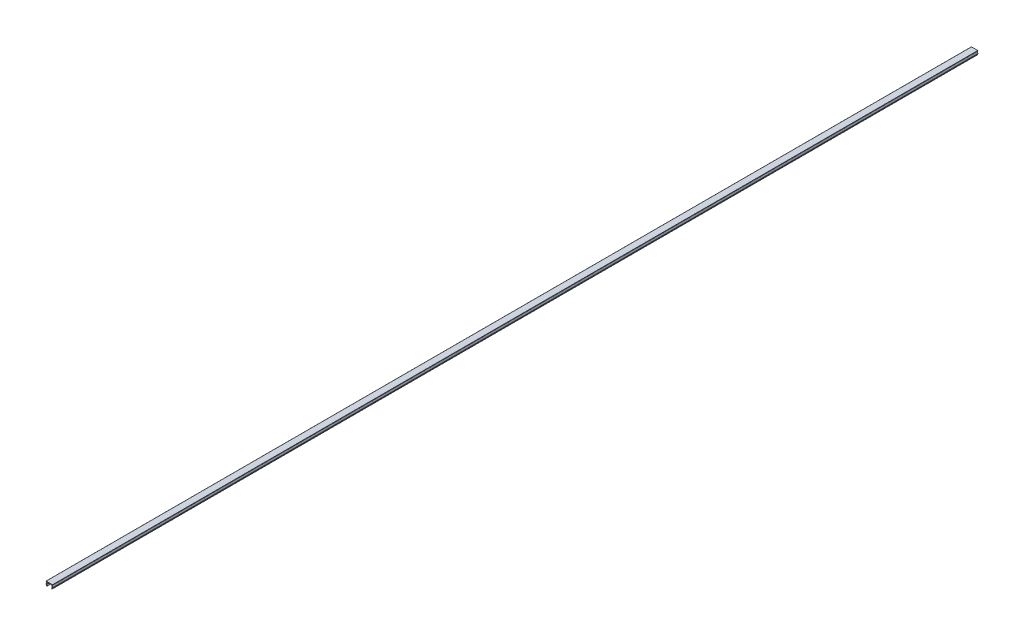
ISO-10303-21;
HEADER;
FILE_DESCRIPTION(('STEP AP214'),'2;1');
FILE_NAME('part.step','',(''),(''),'','','');
FILE_SCHEMA(('AUTOMOTIVE_DESIGN { 1 0 10303 214 1 1 1 1 }'));
ENDSEC;
DATA;
#1=APPLICATION_CONTEXT('core data for automotive mechanical design processes');
#2=APPLICATION_PROTOCOL_DEFINITION('international standard','automotive_design',2000,#1);
#3=PRODUCT_CONTEXT('',#1,'mechanical');
#4=PRODUCT('Part','Part','',(#3));
#5=PRODUCT_RELATED_PRODUCT_CATEGORY('part','',(#4));
#6=PRODUCT_DEFINITION_FORMATION('','',#4);
#7=PRODUCT_DEFINITION_CONTEXT('part definition',#1,'design');
#8=PRODUCT_DEFINITION('design','',#6,#7);
#9=PRODUCT_DEFINITION_SHAPE('','',#8);
#10=(LENGTH_UNIT() NAMED_UNIT(*) SI_UNIT(.MILLI.,.METRE.));
#11=(NAMED_UNIT(*) PLANE_ANGLE_UNIT() SI_UNIT($,.RADIAN.));
#12=(NAMED_UNIT(*) SI_UNIT($,.STERADIAN.) SOLID_ANGLE_UNIT());
#13=UNCERTAINTY_MEASURE_WITH_UNIT(LENGTH_MEASURE(1.E-05),#10,'distance_accuracy_value','');
#14=(GEOMETRIC_REPRESENTATION_CONTEXT(3) GLOBAL_UNCERTAINTY_ASSIGNED_CONTEXT((#13)) GLOBAL_UNIT_ASSIGNED_CONTEXT((#10,
#11,#12)) REPRESENTATION_CONTEXT('',''));
#15=CARTESIAN_POINT('',(0.,0.,0.));
#16=DIRECTION('',(0.,0.,1.));
#17=DIRECTION('',(1.,0.,0.));
#18=AXIS2_PLACEMENT_3D('',#15,#16,#17);
#19=CARTESIAN_POINT('',(3.7477937494903,87.1633342061206,1000.));
#20=DIRECTION('',(0.,0.,-1.));
#21=DIRECTION('',(-1.,0.,0.));
#22=AXIS2_PLACEMENT_3D('',#19,#20,#21);
#23=CYLINDRICAL_SURFACE('',#22,0.5);
#24=CARTESIAN_POINT('',(3.7477937494903,87.1633342061206,0.));
#25=DIRECTION('',(0.,0.,1.));
#26=DIRECTION('',(1.,0.,0.));
#27=AXIS2_PLACEMENT_3D('',#24,#25,#26);
#28=CIRCLE('',#27,0.5);
#29=CARTESIAN_POINT('',(3.25538987298423,87.2501582949543,0.));
#30=VERTEX_POINT('',#29);
#31=CARTESIAN_POINT('',(3.27794743909727,86.992324134458,0.));
#32=VERTEX_POINT('',#31);
#33=EDGE_CURVE('E229',#30,#32,#28,.T.);
#34=ORIENTED_EDGE('',*,*,#33,.T.);
#35=DIRECTION('',(0.,0.,-1.));
#36=VECTOR('',#35,1.);
#37=CARTESIAN_POINT('',(3.27794743909727,86.992324134458,1000.));
#38=LINE('',#37,#36);
#39=CARTESIAN_POINT('',(3.27794743909727,86.992324134458,1000.));
#40=VERTEX_POINT('',#39);
#41=EDGE_CURVE('E11',#40,#32,#38,.T.);
#42=ORIENTED_EDGE('',*,*,#41,.F.);
#43=CARTESIAN_POINT('',(3.7477937494903,87.1633342061206,1000.));
#44=DIRECTION('',(0.,0.,1.));
#45=DIRECTION('',(1.,0.,0.));
#46=AXIS2_PLACEMENT_3D('',#43,#44,#45);
#47=CIRCLE('',#46,0.5);
#48=CARTESIAN_POINT('',(3.25538987298423,87.2501582949543,1000.));
#49=VERTEX_POINT('',#48);
#50=EDGE_CURVE('E275',#49,#40,#47,.T.);
#51=ORIENTED_EDGE('',*,*,#50,.F.);
#52=DIRECTION('',(0.,0.,-1.));
#53=VECTOR('',#52,1.);
#54=CARTESIAN_POINT('',(3.25538987298423,87.2501582949543,1000.));
#55=LINE('',#54,#53);
#56=EDGE_CURVE('E225',#49,#30,#55,.T.);
#57=ORIENTED_EDGE('',*,*,#56,.T.);
#58=EDGE_LOOP('',(#34,#42,#51,#57));
#59=FACE_BOUND('',#58,.T.);
#60=ADVANCED_FACE('F37',(#59),#23,.T.);
#61=CARTESIAN_POINT('',(3.71984554241389,85.7782190738955,1000.));
#62=DIRECTION('',(0.93969262078593,0.342020143325608,0.));
#63=DIRECTION('',(-0.342020143325608,0.93969262078593,0.));
#64=AXIS2_PLACEMENT_3D('',#61,#62,#63);
#65=PLANE('',#64);
#66=DIRECTION('',(0.342020143325608,-0.93969262078593,0.));
#67=VECTOR('',#66,1.);
#68=CARTESIAN_POINT('',(3.71984554241389,85.7782190738955,0.));
#69=LINE('',#68,#67);
#70=CARTESIAN_POINT('',(3.71984554241474,85.7782190738958,0.));
#71=VERTEX_POINT('',#70);
#72=EDGE_CURVE('E232',#32,#71,#69,.T.);
#73=ORIENTED_EDGE('',*,*,#72,.T.);
#74=DIRECTION('',(0.,0.,-1.));
#75=VECTOR('',#74,1.);
#76=CARTESIAN_POINT('',(3.71984554241474,85.7782190738958,1000.));
#77=LINE('',#76,#75);
#78=CARTESIAN_POINT('',(3.71984554241474,85.7782190738958,1000.));
#79=VERTEX_POINT('',#78);
#80=EDGE_CURVE('E45',#79,#71,#77,.T.);
#81=ORIENTED_EDGE('',*,*,#80,.F.);
#82=DIRECTION('',(0.342020143325608,-0.93969262078593,0.));
#83=VECTOR('',#82,1.);
#84=CARTESIAN_POINT('',(3.71984554241389,85.7782190738955,1000.));
#85=LINE('',#84,#83);
#86=EDGE_CURVE('E144',#40,#79,#85,.T.);
#87=ORIENTED_EDGE('',*,*,#86,.F.);
#88=ORIENTED_EDGE('',*,*,#41,.T.);
#89=EDGE_LOOP('',(#73,#81,#87,#88));
#90=FACE_BOUND('',#89,.T.);
#91=ADVANCED_FACE('F413',(#90),#65,.F.);
#92=CARTESIAN_POINT('',(3.94400660807878,85.8598070294793,1000.));
#93=DIRECTION('',(0.,0.,-1.));
#94=DIRECTION('',(-1.,0.,0.));
#95=AXIS2_PLACEMENT_3D('',#92,#93,#94);
#96=CYLINDRICAL_SURFACE('',#95,0.238547223534299);
#97=CARTESIAN_POINT('',(3.94400660807878,85.8598070294793,0.));
#98=DIRECTION('',(0.,0.,1.));
#99=DIRECTION('',(1.,0.,0.));
#100=AXIS2_PLACEMENT_3D('',#97,#98,#99);
#101=CIRCLE('',#100,0.238547223534299);
#102=CARTESIAN_POINT('',(4.16816767374212,85.941394985062,0.));
#103=VERTEX_POINT('',#102);
#104=EDGE_CURVE('E234',#71,#103,#101,.T.);
#105=ORIENTED_EDGE('',*,*,#104,.T.);
#106=DIRECTION('',(0.,0.,-1.));
#107=VECTOR('',#106,1.);
#108=CARTESIAN_POINT('',(4.16816767374212,85.941394985062,1000.));
#109=LINE('',#108,#107);
#110=CARTESIAN_POINT('',(4.16816767374212,85.941394985062,1000.));
#111=VERTEX_POINT('',#110);
#112=EDGE_CURVE('E330',#111,#103,#109,.T.);
#113=ORIENTED_EDGE('',*,*,#112,.F.);
#114=CARTESIAN_POINT('',(3.94400660807878,85.8598070294793,1000.));
#115=DIRECTION('',(0.,0.,1.));
#116=DIRECTION('',(1.,0.,0.));
#117=AXIS2_PLACEMENT_3D('',#114,#115,#116);
#118=CIRCLE('',#117,0.238547223534299);
#119=EDGE_CURVE('E338',#79,#111,#118,.T.);
#120=ORIENTED_EDGE('',*,*,#119,.F.);
#121=ORIENTED_EDGE('',*,*,#80,.T.);
#122=EDGE_LOOP('',(#105,#113,#120,#121));
#123=FACE_BOUND('',#122,.T.);
#124=ADVANCED_FACE('F336',(#123),#96,.T.);
#125=CARTESIAN_POINT('',(3.74900313655878,87.0930400860075,1000.));
#126=DIRECTION('',(-0.939692620785726,-0.342020143326169,0.));
#127=DIRECTION('',(0.342020143326169,-0.939692620785726,0.));
#128=AXIS2_PLACEMENT_3D('',#125,#126,#127);
#129=PLANE('',#128);
#130=DIRECTION('',(-0.342020143326169,0.939692620785726,0.));
#131=VECTOR('',#130,1.);
#132=CARTESIAN_POINT('',(3.74900313655878,87.0930400860075,0.));
#133=LINE('',#132,#131);
#134=CARTESIAN_POINT('',(3.74900313655878,87.0930400860075,0.));
#135=VERTEX_POINT('',#134);
#136=EDGE_CURVE('E236',#103,#135,#133,.T.);
#137=ORIENTED_EDGE('',*,*,#136,.T.);
#138=DIRECTION('',(0.,0.,-1.));
#139=VECTOR('',#138,1.);
#140=CARTESIAN_POINT('',(3.74900313655878,87.0930400860075,1000.));
#141=LINE('',#140,#139);
#142=CARTESIAN_POINT('',(3.74900313655878,87.0930400860075,1000.));
#143=VERTEX_POINT('',#142);
#144=EDGE_CURVE('E327',#143,#135,#141,.T.);
#145=ORIENTED_EDGE('',*,*,#144,.F.);
#146=DIRECTION('',(-0.342020143326169,0.939692620785726,0.));
#147=VECTOR('',#146,1.);
#148=CARTESIAN_POINT('',(3.74900313655878,87.0930400860075,1000.));
#149=LINE('',#148,#147);
#150=EDGE_CURVE('E356',#111,#143,#149,.T.);
#151=ORIENTED_EDGE('',*,*,#150,.F.);
#152=ORIENTED_EDGE('',*,*,#112,.T.);
#153=EDGE_LOOP('',(#137,#145,#151,#152));
#154=FACE_BOUND('',#153,.T.);
#155=ADVANCED_FACE('F347',(#154),#129,.F.);
#156=CARTESIAN_POINT('',(3.84297239863858,87.1272421003405,1000.));
#157=DIRECTION('',(0.,0.,-1.));
#158=DIRECTION('',(-1.,0.,0.));
#159=AXIS2_PLACEMENT_3D('',#156,#157,#158);
#160=CYLINDRICAL_SURFACE('',#159,0.100000000001303);
#161=CARTESIAN_POINT('',(3.84297239863858,87.1272421003405,0.));
#162=DIRECTION('',(0.,0.,-1.));
#163=DIRECTION('',(1.,0.,0.));
#164=AXIS2_PLACEMENT_3D('',#161,#162,#163);
#165=CIRCLE('',#164,0.100000000001303);
#166=CARTESIAN_POINT('',(3.74449162333608,87.1446069181075,0.));
#167=VERTEX_POINT('',#166);
#168=EDGE_CURVE('E238',#135,#167,#165,.T.);
#169=ORIENTED_EDGE('',*,*,#168,.T.);
#170=DIRECTION('',(0.,0.,-1.));
#171=VECTOR('',#170,1.);
#172=CARTESIAN_POINT('',(3.74449162333608,87.1446069181075,1000.));
#173=LINE('',#172,#171);
#174=CARTESIAN_POINT('',(3.74449162333608,87.1446069181075,1000.));
#175=VERTEX_POINT('',#174);
#176=EDGE_CURVE('E324',#175,#167,#173,.T.);
#177=ORIENTED_EDGE('',*,*,#176,.F.);
#178=CARTESIAN_POINT('',(3.84297239863858,87.1272421003405,1000.));
#179=DIRECTION('',(0.,0.,-1.));
#180=DIRECTION('',(1.,0.,0.));
#181=AXIS2_PLACEMENT_3D('',#178,#179,#180);
#182=CIRCLE('',#181,0.100000000001303);
#183=EDGE_CURVE('E353',#143,#175,#182,.T.);
#184=ORIENTED_EDGE('',*,*,#183,.F.);
#185=ORIENTED_EDGE('',*,*,#144,.T.);
#186=EDGE_LOOP('',(#169,#177,#184,#185));
#187=FACE_BOUND('',#186,.T.);
#188=ADVANCED_FACE('F351',(#187),#160,.F.);
#189=CARTESIAN_POINT('',(4.18065618621034,89.6182190738957,1000.));
#190=DIRECTION('',(-0.984807753012184,0.173648177667068,0.));
#191=DIRECTION('',(-0.173648177667068,-0.984807753012184,0.));
#192=AXIS2_PLACEMENT_3D('',#189,#190,#191);
#193=PLANE('',#192);
#194=DIRECTION('',(0.173648177667068,0.984807753012184,0.));
#195=VECTOR('',#194,1.);
#196=CARTESIAN_POINT('',(4.18065618621034,89.6182190738957,0.));
#197=LINE('',#196,#195);
#198=CARTESIAN_POINT('',(4.18065618621034,89.6182190738957,0.));
#199=VERTEX_POINT('',#198);
#200=EDGE_CURVE('E240',#167,#199,#197,.T.);
#201=ORIENTED_EDGE('',*,*,#200,.T.);
#202=DIRECTION('',(0.,0.,-1.));
#203=VECTOR('',#202,1.);
#204=CARTESIAN_POINT('',(4.18065618621034,89.6182190738957,1000.));
#205=LINE('',#204,#203);
#206=CARTESIAN_POINT('',(4.18065618621034,89.6182190738957,1000.));
#207=VERTEX_POINT('',#206);
#208=EDGE_CURVE('E321',#207,#199,#205,.T.);
#209=ORIENTED_EDGE('',*,*,#208,.F.);
#210=DIRECTION('',(0.173648177667068,0.984807753012184,0.));
#211=VECTOR('',#210,1.);
#212=CARTESIAN_POINT('',(4.18065618621034,89.6182190738957,1000.));
#213=LINE('',#212,#211);
#214=EDGE_CURVE('E355',#175,#207,#213,.T.);
#215=ORIENTED_EDGE('',*,*,#214,.F.);
#216=ORIENTED_EDGE('',*,*,#176,.T.);
#217=EDGE_LOOP('',(#201,#209,#215,#216));
#218=FACE_BOUND('',#217,.T.);
#219=ADVANCED_FACE('F426',(#218),#193,.F.);
#220=CARTESIAN_POINT('',(9.16522957432238,89.6182190738957,1000.));
#221=DIRECTION('',(0.,1.,0.));
#222=DIRECTION('',(0.,0.,1.));
#223=AXIS2_PLACEMENT_3D('',#220,#221,#222);
#224=PLANE('',#223);
#225=DIRECTION('',(1.,0.,0.));
#226=VECTOR('',#225,1.);
#227=CARTESIAN_POINT('',(9.16522957432238,89.6182190738957,0.));
#228=LINE('',#227,#226);
#229=CARTESIAN_POINT('',(9.16522957432238,89.6182190738957,0.));
#230=VERTEX_POINT('',#229);
#231=EDGE_CURVE('E242',#199,#230,#228,.T.);
#232=ORIENTED_EDGE('',*,*,#231,.T.);
#233=DIRECTION('',(0.,0.,-1.));
#234=VECTOR('',#233,1.);
#235=CARTESIAN_POINT('',(9.16522957432238,89.6182190738957,1000.));
#236=LINE('',#235,#234);
#237=CARTESIAN_POINT('',(9.16522957432238,89.6182190738957,1000.));
#238=VERTEX_POINT('',#237);
#239=EDGE_CURVE('E318',#238,#230,#236,.T.);
#240=ORIENTED_EDGE('',*,*,#239,.F.);
#241=DIRECTION('',(1.,0.,0.));
#242=VECTOR('',#241,1.);
#243=CARTESIAN_POINT('',(9.16522957432238,89.6182190738957,1000.));
#244=LINE('',#243,#242);
#245=EDGE_CURVE('E358',#207,#238,#244,.T.);
#246=ORIENTED_EDGE('',*,*,#245,.F.);
#247=ORIENTED_EDGE('',*,*,#208,.T.);
#248=EDGE_LOOP('',(#232,#240,#246,#247));
#249=FACE_BOUND('',#248,.T.);
#250=ADVANCED_FACE('F429',(#249),#224,.F.);
#251=CARTESIAN_POINT('',(9.60139413719656,87.1446069181068,1000.));
#252=DIRECTION('',(0.984807753012197,0.173648177666994,0.));
#253=DIRECTION('',(-0.173648177666994,0.984807753012197,0.));
#254=AXIS2_PLACEMENT_3D('',#251,#252,#253);
#255=PLANE('',#254);
#256=DIRECTION('',(0.173648177666994,-0.984807753012197,0.));
#257=VECTOR('',#256,1.);
#258=CARTESIAN_POINT('',(9.60139413719656,87.1446069181068,0.));
#259=LINE('',#258,#257);
#260=CARTESIAN_POINT('',(9.60139413719656,87.1446069181068,0.));
#261=VERTEX_POINT('',#260);
#262=EDGE_CURVE('E244',#230,#261,#259,.T.);
#263=ORIENTED_EDGE('',*,*,#262,.T.);
#264=DIRECTION('',(0.,0.,-1.));
#265=VECTOR('',#264,1.);
#266=CARTESIAN_POINT('',(9.60139413719656,87.1446069181068,1000.));
#267=LINE('',#266,#265);
#268=CARTESIAN_POINT('',(9.60139413719656,87.1446069181068,1000.));
#269=VERTEX_POINT('',#268);
#270=EDGE_CURVE('E315',#269,#261,#267,.T.);
#271=ORIENTED_EDGE('',*,*,#270,.F.);
#272=DIRECTION('',(0.173648177666994,-0.984807753012197,0.));
#273=VECTOR('',#272,1.);
#274=CARTESIAN_POINT('',(9.60139413719656,87.1446069181068,1000.));
#275=LINE('',#274,#273);
#276=EDGE_CURVE('E364',#238,#269,#275,.T.);
#277=ORIENTED_EDGE('',*,*,#276,.F.);
#278=ORIENTED_EDGE('',*,*,#239,.T.);
#279=EDGE_LOOP('',(#263,#271,#277,#278));
#280=FACE_BOUND('',#279,.T.);
#281=ADVANCED_FACE('F433',(#280),#255,.F.);
#282=CARTESIAN_POINT('',(9.50291336189533,87.1272421003407,1000.));
#283=DIRECTION('',(0.,0.,-1.));
#284=DIRECTION('',(-1.,0.,0.));
#285=AXIS2_PLACEMENT_3D('',#282,#283,#284);
#286=CYLINDRICAL_SURFACE('',#285,0.0999999999999064);
#287=CARTESIAN_POINT('',(9.50291336189533,87.1272421003407,0.));
#288=DIRECTION('',(0.,0.,-1.));
#289=DIRECTION('',(1.,0.,0.));
#290=AXIS2_PLACEMENT_3D('',#287,#288,#289);
#291=CIRCLE('',#290,0.0999999999999064);
#292=CARTESIAN_POINT('',(9.59688262397385,87.0930400860082,0.));
#293=VERTEX_POINT('',#292);
#294=EDGE_CURVE('E246',#261,#293,#291,.T.);
#295=ORIENTED_EDGE('',*,*,#294,.T.);
#296=DIRECTION('',(0.,0.,-1.));
#297=VECTOR('',#296,1.);
#298=CARTESIAN_POINT('',(9.59688262397385,87.0930400860082,1000.));
#299=LINE('',#298,#297);
#300=CARTESIAN_POINT('',(9.59688262397385,87.0930400860082,1000.));
#301=VERTEX_POINT('',#300);
#302=EDGE_CURVE('E312',#301,#293,#299,.T.);
#303=ORIENTED_EDGE('',*,*,#302,.F.);
#304=CARTESIAN_POINT('',(9.50291336189533,87.1272421003407,1000.));
#305=DIRECTION('',(0.,0.,-1.));
#306=DIRECTION('',(1.,0.,0.));
#307=AXIS2_PLACEMENT_3D('',#304,#305,#306);
#308=CIRCLE('',#307,0.0999999999999064);
#309=EDGE_CURVE('E366',#269,#301,#308,.T.);
#310=ORIENTED_EDGE('',*,*,#309,.F.);
#311=ORIENTED_EDGE('',*,*,#270,.T.);
#312=EDGE_LOOP('',(#295,#303,#310,#311));
#313=FACE_BOUND('',#312,.T.);
#314=ADVANCED_FACE('F437',(#313),#286,.F.);
#315=CARTESIAN_POINT('',(9.1777180867905,85.9413949850629,1000.));
#316=DIRECTION('',(0.939692620785708,-0.342020143326218,0.));
#317=DIRECTION('',(0.342020143326218,0.939692620785708,0.));
#318=AXIS2_PLACEMENT_3D('',#315,#316,#317);
#319=PLANE('',#318);
#320=DIRECTION('',(-0.342020143326218,-0.939692620785708,0.));
#321=VECTOR('',#320,1.);
#322=CARTESIAN_POINT('',(9.1777180867905,85.9413949850629,0.));
#323=LINE('',#322,#321);
#324=CARTESIAN_POINT('',(9.1777180867905,85.9413949850629,0.));
#325=VERTEX_POINT('',#324);
#326=EDGE_CURVE('E248',#293,#325,#323,.T.);
#327=ORIENTED_EDGE('',*,*,#326,.T.);
#328=DIRECTION('',(0.,0.,-1.));
#329=VECTOR('',#328,1.);
#330=CARTESIAN_POINT('',(9.1777180867905,85.9413949850629,1000.));
#331=LINE('',#330,#329);
#332=CARTESIAN_POINT('',(9.1777180867905,85.9413949850629,1000.));
#333=VERTEX_POINT('',#332);
#334=EDGE_CURVE('E309',#333,#325,#331,.T.);
#335=ORIENTED_EDGE('',*,*,#334,.F.);
#336=DIRECTION('',(-0.342020143326218,-0.939692620785708,0.));
#337=VECTOR('',#336,1.);
#338=CARTESIAN_POINT('',(9.1777180867905,85.9413949850629,1000.));
#339=LINE('',#338,#337);
#340=EDGE_CURVE('E368',#301,#333,#339,.T.);
#341=ORIENTED_EDGE('',*,*,#340,.F.);
#342=ORIENTED_EDGE('',*,*,#302,.T.);
#343=EDGE_LOOP('',(#327,#335,#341,#342));
#344=FACE_BOUND('',#343,.T.);
#345=ADVANCED_FACE('F441',(#344),#319,.F.);
#346=CARTESIAN_POINT('',(9.4018791524562,85.8598070294791,1000.));
#347=DIRECTION('',(0.,0.,-1.));
#348=DIRECTION('',(-1.,0.,0.));
#349=AXIS2_PLACEMENT_3D('',#346,#347,#348);
#350=CYLINDRICAL_SURFACE('',#349,0.238547223536003);
#351=CARTESIAN_POINT('',(9.4018791524562,85.8598070294791,0.));
#352=DIRECTION('',(0.,0.,1.));
#353=DIRECTION('',(1.,0.,0.));
#354=AXIS2_PLACEMENT_3D('',#351,#352,#353);
#355=CIRCLE('',#354,0.238547223536003);
#356=CARTESIAN_POINT('',(9.62604021812199,85.7782190738955,0.));
#357=VERTEX_POINT('',#356);
#358=EDGE_CURVE('E250',#325,#357,#355,.T.);
#359=ORIENTED_EDGE('',*,*,#358,.T.);
#360=DIRECTION('',(0.,0.,-1.));
#361=VECTOR('',#360,1.);
#362=CARTESIAN_POINT('',(9.62604021812199,85.7782190738955,1000.));
#363=LINE('',#362,#361);
#364=CARTESIAN_POINT('',(9.62604021812199,85.7782190738955,1000.));
#365=VERTEX_POINT('',#364);
#366=EDGE_CURVE('E306',#365,#357,#363,.T.);
#367=ORIENTED_EDGE('',*,*,#366,.F.);
#368=CARTESIAN_POINT('',(9.4018791524562,85.8598070294791,1000.));
#369=DIRECTION('',(0.,0.,1.));
#370=DIRECTION('',(1.,0.,0.));
#371=AXIS2_PLACEMENT_3D('',#368,#369,#370);
#372=CIRCLE('',#371,0.238547223536003);
#373=EDGE_CURVE('E370',#333,#365,#372,.T.);
#374=ORIENTED_EDGE('',*,*,#373,.F.);
#375=ORIENTED_EDGE('',*,*,#334,.T.);
#376=EDGE_LOOP('',(#359,#367,#374,#375));
#377=FACE_BOUND('',#376,.T.);
#378=ADVANCED_FACE('F445',(#377),#350,.T.);
#379=CARTESIAN_POINT('',(10.0679383214372,86.992324134458,1000.));
#380=DIRECTION('',(-0.939692620786294,0.342020143324609,0.));
#381=DIRECTION('',(-0.342020143324609,-0.939692620786294,0.));
#382=AXIS2_PLACEMENT_3D('',#379,#380,#381);
#383=PLANE('',#382);
#384=DIRECTION('',(0.342020143324609,0.939692620786294,0.));
#385=VECTOR('',#384,1.);
#386=CARTESIAN_POINT('',(10.0679383214372,86.992324134458,0.));
#387=LINE('',#386,#385);
#388=CARTESIAN_POINT('',(10.0679383214372,86.992324134458,0.));
#389=VERTEX_POINT('',#388);
#390=EDGE_CURVE('E252',#357,#389,#387,.T.);
#391=ORIENTED_EDGE('',*,*,#390,.T.);
#392=DIRECTION('',(0.,0.,-1.));
#393=VECTOR('',#392,1.);
#394=CARTESIAN_POINT('',(10.0679383214372,86.992324134458,1000.));
#395=LINE('',#394,#393);
#396=CARTESIAN_POINT('',(10.0679383214372,86.992324134458,1000.));
#397=VERTEX_POINT('',#396);
#398=EDGE_CURVE('E303',#397,#389,#395,.T.);
#399=ORIENTED_EDGE('',*,*,#398,.F.);
#400=DIRECTION('',(0.342020143324609,0.939692620786294,0.));
#401=VECTOR('',#400,1.);
#402=CARTESIAN_POINT('',(10.0679383214372,86.992324134458,1000.));
#403=LINE('',#402,#401);
#404=EDGE_CURVE('E372',#365,#397,#403,.T.);
#405=ORIENTED_EDGE('',*,*,#404,.F.);
#406=ORIENTED_EDGE('',*,*,#366,.T.);
#407=EDGE_LOOP('',(#391,#399,#405,#406));
#408=FACE_BOUND('',#407,.T.);
#409=ADVANCED_FACE('F449',(#408),#383,.F.);
#410=CARTESIAN_POINT('',(9.59809201104454,87.1633342061208,1000.));
#411=DIRECTION('',(0.,0.,-1.));
#412=DIRECTION('',(-1.,0.,0.));
#413=AXIS2_PLACEMENT_3D('',#410,#411,#412);
#414=CYLINDRICAL_SURFACE('',#413,0.499999999999682);
#415=CARTESIAN_POINT('',(9.59809201104454,87.1633342061208,0.));
#416=DIRECTION('',(0.,0.,1.));
#417=DIRECTION('',(1.,0.,0.));
#418=AXIS2_PLACEMENT_3D('',#415,#416,#417);
#419=CIRCLE('',#418,0.499999999999682);
#420=CARTESIAN_POINT('',(10.0904958875503,87.2501582949544,0.));
#421=VERTEX_POINT('',#420);
#422=EDGE_CURVE('E254',#389,#421,#419,.T.);
#423=ORIENTED_EDGE('',*,*,#422,.T.);
#424=DIRECTION('',(0.,0.,-1.));
#425=VECTOR('',#424,1.);
#426=CARTESIAN_POINT('',(10.0904958875503,87.2501582949544,1000.));
#427=LINE('',#426,#425);
#428=CARTESIAN_POINT('',(10.0904958875503,87.2501582949544,1000.));
#429=VERTEX_POINT('',#428);
#430=EDGE_CURVE('E300',#429,#421,#427,.T.);
#431=ORIENTED_EDGE('',*,*,#430,.F.);
#432=CARTESIAN_POINT('',(9.59809201104454,87.1633342061208,1000.));
#433=DIRECTION('',(0.,0.,1.));
#434=DIRECTION('',(1.,0.,0.));
#435=AXIS2_PLACEMENT_3D('',#432,#433,#434);
#436=CIRCLE('',#435,0.499999999999682);
#437=EDGE_CURVE('E374',#397,#429,#436,.T.);
#438=ORIENTED_EDGE('',*,*,#437,.F.);
#439=ORIENTED_EDGE('',*,*,#398,.T.);
#440=EDGE_LOOP('',(#423,#431,#438,#439));
#441=FACE_BOUND('',#440,.T.);
#442=ADVANCED_FACE('F453',(#441),#414,.T.);
#443=CARTESIAN_POINT('',(9.67294288026739,89.6182190738958,1000.));
#444=DIRECTION('',(-0.984807753012347,-0.173648177666142,0.));
#445=DIRECTION('',(0.173648177666142,-0.984807753012347,0.));
#446=AXIS2_PLACEMENT_3D('',#443,#444,#445);
#447=PLANE('',#446);
#448=DIRECTION('',(-0.173648177666142,0.984807753012347,0.));
#449=VECTOR('',#448,1.);
#450=CARTESIAN_POINT('',(9.67294288026739,89.6182190738958,0.));
#451=LINE('',#450,#449);
#452=CARTESIAN_POINT('',(9.67294288026739,89.6182190738958,0.));
#453=VERTEX_POINT('',#452);
#454=EDGE_CURVE('E256',#421,#453,#451,.T.);
#455=ORIENTED_EDGE('',*,*,#454,.T.);
#456=DIRECTION('',(0.,0.,-1.));
#457=VECTOR('',#456,1.);
#458=CARTESIAN_POINT('',(9.67294288026739,89.6182190738958,1000.));
#459=LINE('',#458,#457);
#460=CARTESIAN_POINT('',(9.67294288026739,89.6182190738958,1000.));
#461=VERTEX_POINT('',#460);
#462=EDGE_CURVE('E297',#461,#453,#459,.T.);
#463=ORIENTED_EDGE('',*,*,#462,.F.);
#464=DIRECTION('',(-0.173648177666142,0.984807753012347,0.));
#465=VECTOR('',#464,1.);
#466=CARTESIAN_POINT('',(9.67294288026739,89.6182190738958,1000.));
#467=LINE('',#466,#465);
#468=EDGE_CURVE('E376',#429,#461,#467,.T.);
#469=ORIENTED_EDGE('',*,*,#468,.F.);
#470=ORIENTED_EDGE('',*,*,#430,.T.);
#471=EDGE_LOOP('',(#455,#463,#469,#470));
#472=FACE_BOUND('',#471,.T.);
#473=ADVANCED_FACE('F457',(#472),#447,.F.);
#474=CARTESIAN_POINT('',(10.1729428802699,89.6182190738958,1000.));
#475=DIRECTION('',(0.,1.,0.));
#476=DIRECTION('',(0.,0.,1.));
#477=AXIS2_PLACEMENT_3D('',#474,#475,#476);
#478=PLANE('',#477);
#479=DIRECTION('',(1.,0.,0.));
#480=VECTOR('',#479,1.);
#481=CARTESIAN_POINT('',(10.1729428802699,89.6182190738958,0.));
#482=LINE('',#481,#480);
#483=CARTESIAN_POINT('',(10.1729428802699,89.6182190738958,0.));
#484=VERTEX_POINT('',#483);
#485=EDGE_CURVE('E258',#453,#484,#482,.T.);
#486=ORIENTED_EDGE('',*,*,#485,.T.);
#487=DIRECTION('',(0.,0.,-1.));
#488=VECTOR('',#487,1.);
#489=CARTESIAN_POINT('',(10.1729428802699,89.6182190738958,1000.));
#490=LINE('',#489,#488);
#491=CARTESIAN_POINT('',(10.1729428802699,89.6182190738958,1000.));
#492=VERTEX_POINT('',#491);
#493=EDGE_CURVE('E294',#492,#484,#490,.T.);
#494=ORIENTED_EDGE('',*,*,#493,.F.);
#495=DIRECTION('',(1.,0.,0.));
#496=VECTOR('',#495,1.);
#497=CARTESIAN_POINT('',(10.1729428802699,89.6182190738958,1000.));
#498=LINE('',#497,#496);
#499=EDGE_CURVE('E378',#461,#492,#498,.T.);
#500=ORIENTED_EDGE('',*,*,#499,.F.);
#501=ORIENTED_EDGE('',*,*,#462,.T.);
#502=EDGE_LOOP('',(#486,#494,#500,#501));
#503=FACE_BOUND('',#502,.T.);
#504=ADVANCED_FACE('F461',(#503),#478,.F.);
#505=CARTESIAN_POINT('',(10.1729428802699,89.718219073896,1000.));
#506=DIRECTION('',(0.,0.,-1.));
#507=DIRECTION('',(-1.,0.,0.));
#508=AXIS2_PLACEMENT_3D('',#505,#506,#507);
#509=CYLINDRICAL_SURFACE('',#508,0.100000000000186);
#510=CARTESIAN_POINT('',(10.1729428802699,89.718219073896,0.));
#511=DIRECTION('',(0.,0.,1.));
#512=DIRECTION('',(1.,0.,0.));
#513=AXIS2_PLACEMENT_3D('',#510,#511,#512);
#514=CIRCLE('',#513,0.100000000000186);
#515=CARTESIAN_POINT('',(10.2729428802701,89.7182190738968,0.));
#516=VERTEX_POINT('',#515);
#517=EDGE_CURVE('E260',#484,#516,#514,.T.);
#518=ORIENTED_EDGE('',*,*,#517,.T.);
#519=DIRECTION('',(0.,0.,-1.));
#520=VECTOR('',#519,1.);
#521=CARTESIAN_POINT('',(10.2729428802701,89.7182190738968,1000.));
#522=LINE('',#521,#520);
#523=CARTESIAN_POINT('',(10.2729428802701,89.7182190738968,1000.));
#524=VERTEX_POINT('',#523);
#525=EDGE_CURVE('E291',#524,#516,#522,.T.);
#526=ORIENTED_EDGE('',*,*,#525,.F.);
#527=CARTESIAN_POINT('',(10.1729428802699,89.718219073896,1000.));
#528=DIRECTION('',(0.,0.,1.));
#529=DIRECTION('',(1.,0.,0.));
#530=AXIS2_PLACEMENT_3D('',#527,#528,#529);
#531=CIRCLE('',#530,0.100000000000186);
#532=EDGE_CURVE('E380',#492,#524,#531,.T.);
#533=ORIENTED_EDGE('',*,*,#532,.F.);
#534=ORIENTED_EDGE('',*,*,#493,.T.);
#535=EDGE_LOOP('',(#518,#526,#533,#534));
#536=FACE_BOUND('',#535,.T.);
#537=ADVANCED_FACE('F465',(#536),#509,.T.);
#538=CARTESIAN_POINT('',(10.2729428802704,89.9182190738957,1000.));
#539=DIRECTION('',(-1.,1.81278603240565E-12,0.));
#540=DIRECTION('',(-1.81278603240565E-12,-1.,0.));
#541=AXIS2_PLACEMENT_3D('',#538,#539,#540);
#542=PLANE('',#541);
#543=DIRECTION('',(1.81278603240565E-12,1.,0.));
#544=VECTOR('',#543,1.);
#545=CARTESIAN_POINT('',(10.2729428802704,89.9182190738957,0.));
#546=LINE('',#545,#544);
#547=CARTESIAN_POINT('',(10.2729428802701,89.9182190738957,0.));
#548=VERTEX_POINT('',#547);
#549=EDGE_CURVE('E262',#516,#548,#546,.T.);
#550=ORIENTED_EDGE('',*,*,#549,.T.);
#551=DIRECTION('',(0.,0.,-1.));
#552=VECTOR('',#551,1.);
#553=CARTESIAN_POINT('',(10.2729428802701,89.9182190738957,1000.));
#554=LINE('',#553,#552);
#555=CARTESIAN_POINT('',(10.2729428802701,89.9182190738957,1000.));
#556=VERTEX_POINT('',#555);
#557=EDGE_CURVE('E288',#556,#548,#554,.T.);
#558=ORIENTED_EDGE('',*,*,#557,.F.);
#559=DIRECTION('',(1.81278603240565E-12,1.,0.));
#560=VECTOR('',#559,1.);
#561=CARTESIAN_POINT('',(10.2729428802704,89.9182190738957,1000.));
#562=LINE('',#561,#560);
#563=EDGE_CURVE('E382',#524,#556,#562,.T.);
#564=ORIENTED_EDGE('',*,*,#563,.F.);
#565=ORIENTED_EDGE('',*,*,#525,.T.);
#566=EDGE_LOOP('',(#550,#558,#564,#565));
#567=FACE_BOUND('',#566,.T.);
#568=ADVANCED_FACE('F469',(#567),#542,.F.);
#569=CARTESIAN_POINT('',(10.0729428802697,89.9182190738957,1000.));
#570=DIRECTION('',(0.,0.,-1.));
#571=DIRECTION('',(-1.,0.,0.));
#572=AXIS2_PLACEMENT_3D('',#569,#570,#571);
#573=CYLINDRICAL_SURFACE('',#572,0.200000000000368);
#574=CARTESIAN_POINT('',(10.0729428802697,89.9182190738957,0.));
#575=DIRECTION('',(0.,0.,1.));
#576=DIRECTION('',(1.,0.,0.));
#577=AXIS2_PLACEMENT_3D('',#574,#575,#576);
#578=CIRCLE('',#577,0.200000000000368);
#579=CARTESIAN_POINT('',(10.0729428802697,90.1182190738957,0.));
#580=VERTEX_POINT('',#579);
#581=EDGE_CURVE('E264',#548,#580,#578,.T.);
#582=ORIENTED_EDGE('',*,*,#581,.T.);
#583=DIRECTION('',(0.,0.,-1.));
#584=VECTOR('',#583,1.);
#585=CARTESIAN_POINT('',(10.0729428802697,90.1182190738957,1000.));
#586=LINE('',#585,#584);
#587=CARTESIAN_POINT('',(10.0729428802697,90.1182190738957,1000.));
#588=VERTEX_POINT('',#587);
#589=EDGE_CURVE('E285',#588,#580,#586,.T.);
#590=ORIENTED_EDGE('',*,*,#589,.F.);
#591=CARTESIAN_POINT('',(10.0729428802697,89.9182190738957,1000.));
#592=DIRECTION('',(0.,0.,1.));
#593=DIRECTION('',(1.,0.,0.));
#594=AXIS2_PLACEMENT_3D('',#591,#592,#593);
#595=CIRCLE('',#594,0.200000000000368);
#596=EDGE_CURVE('E384',#556,#588,#595,.T.);
#597=ORIENTED_EDGE('',*,*,#596,.F.);
#598=ORIENTED_EDGE('',*,*,#557,.T.);
#599=EDGE_LOOP('',(#582,#590,#597,#598));
#600=FACE_BOUND('',#599,.T.);
#601=ADVANCED_FACE('F473',(#600),#573,.T.);
#602=CARTESIAN_POINT('',(3.27294288027042,90.1182190738964,1000.));
#603=DIRECTION('',(-1.06124259706828E-13,-1.,0.));
#604=DIRECTION('',(1.,-1.06124259706828E-13,0.));
#605=AXIS2_PLACEMENT_3D('',#602,#603,#604);
#606=PLANE('',#605);
#607=DIRECTION('',(-1.,1.06124259706828E-13,0.));
#608=VECTOR('',#607,1.);
#609=CARTESIAN_POINT('',(3.27294288027042,90.1182190738964,0.));
#610=LINE('',#609,#608);
#611=CARTESIAN_POINT('',(3.27294288027042,90.118219073896,0.));
#612=VERTEX_POINT('',#611);
#613=EDGE_CURVE('E266',#580,#612,#610,.T.);
#614=ORIENTED_EDGE('',*,*,#613,.T.);
#615=DIRECTION('',(0.,0.,-1.));
#616=VECTOR('',#615,1.);
#617=CARTESIAN_POINT('',(3.27294288027042,90.118219073896,1000.));
#618=LINE('',#617,#616);
#619=CARTESIAN_POINT('',(3.27294288027042,90.118219073896,1000.));
#620=VERTEX_POINT('',#619);
#621=EDGE_CURVE('E282',#620,#612,#618,.T.);
#622=ORIENTED_EDGE('',*,*,#621,.F.);
#623=DIRECTION('',(-1.,1.06124259706828E-13,0.));
#624=VECTOR('',#623,1.);
#625=CARTESIAN_POINT('',(3.27294288027042,90.1182190738964,1000.));
#626=LINE('',#625,#624);
#627=EDGE_CURVE('E386',#588,#620,#626,.T.);
#628=ORIENTED_EDGE('',*,*,#627,.F.);
#629=ORIENTED_EDGE('',*,*,#589,.T.);
#630=EDGE_LOOP('',(#614,#622,#628,#629));
#631=FACE_BOUND('',#630,.T.);
#632=ADVANCED_FACE('F477',(#631),#606,.F.);
#633=CARTESIAN_POINT('',(3.27294288027042,89.9182190738957,1000.));
#634=DIRECTION('',(0.,0.,-1.));
#635=DIRECTION('',(-1.,0.,0.));
#636=AXIS2_PLACEMENT_3D('',#633,#634,#635);
#637=CYLINDRICAL_SURFACE('',#636,0.200000000000364);
#638=CARTESIAN_POINT('',(3.27294288027042,89.9182190738957,0.));
#639=DIRECTION('',(0.,0.,1.));
#640=DIRECTION('',(1.,0.,0.));
#641=AXIS2_PLACEMENT_3D('',#638,#639,#640);
#642=CIRCLE('',#641,0.200000000000364);
#643=CARTESIAN_POINT('',(3.07294288027042,89.9182190738957,0.));
#644=VERTEX_POINT('',#643);
#645=EDGE_CURVE('E268',#612,#644,#642,.T.);
#646=ORIENTED_EDGE('',*,*,#645,.T.);
#647=DIRECTION('',(0.,0.,-1.));
#648=VECTOR('',#647,1.);
#649=CARTESIAN_POINT('',(3.07294288027042,89.9182190738957,1000.));
#650=LINE('',#649,#648);
#651=CARTESIAN_POINT('',(3.07294288027042,89.9182190738957,1000.));
#652=VERTEX_POINT('',#651);
#653=EDGE_CURVE('E279',#652,#644,#650,.T.);
#654=ORIENTED_EDGE('',*,*,#653,.F.);
#655=CARTESIAN_POINT('',(3.27294288027042,89.9182190738957,1000.));
#656=DIRECTION('',(0.,0.,1.));
#657=DIRECTION('',(1.,0.,0.));
#658=AXIS2_PLACEMENT_3D('',#655,#656,#657);
#659=CIRCLE('',#658,0.200000000000364);
#660=EDGE_CURVE('E388',#620,#652,#659,.T.);
#661=ORIENTED_EDGE('',*,*,#660,.F.);
#662=ORIENTED_EDGE('',*,*,#621,.T.);
#663=EDGE_LOOP('',(#646,#654,#661,#662));
#664=FACE_BOUND('',#663,.T.);
#665=ADVANCED_FACE('F394',(#664),#637,.T.);
#666=CARTESIAN_POINT('',(3.07294288026969,89.7182190738968,1000.));
#667=DIRECTION('',(1.,-3.63858249088119E-12,0.));
#668=DIRECTION('',(3.63858249088119E-12,1.,0.));
#669=AXIS2_PLACEMENT_3D('',#666,#667,#668);
#670=PLANE('',#669);
#671=DIRECTION('',(-3.63858249088119E-12,-1.,0.));
#672=VECTOR('',#671,1.);
#673=CARTESIAN_POINT('',(3.07294288026969,89.7182190738968,0.));
#674=LINE('',#673,#672);
#675=CARTESIAN_POINT('',(3.07294288026969,89.7182190738968,0.));
#676=VERTEX_POINT('',#675);
#677=EDGE_CURVE('E270',#644,#676,#674,.T.);
#678=ORIENTED_EDGE('',*,*,#677,.T.);
#679=DIRECTION('',(0.,0.,-1.));
#680=VECTOR('',#679,1.);
#681=CARTESIAN_POINT('',(3.07294288026969,89.7182190738968,1000.));
#682=LINE('',#681,#680);
#683=CARTESIAN_POINT('',(3.07294288026969,89.7182190738968,1000.));
#684=VERTEX_POINT('',#683);
#685=EDGE_CURVE('E220',#684,#676,#682,.T.);
#686=ORIENTED_EDGE('',*,*,#685,.F.);
#687=DIRECTION('',(-3.63858249088119E-12,-1.,0.));
#688=VECTOR('',#687,1.);
#689=CARTESIAN_POINT('',(3.07294288026969,89.7182190738968,1000.));
#690=LINE('',#689,#688);
#691=EDGE_CURVE('E211',#652,#684,#690,.T.);
#692=ORIENTED_EDGE('',*,*,#691,.F.);
#693=ORIENTED_EDGE('',*,*,#653,.T.);
#694=EDGE_LOOP('',(#678,#686,#692,#693));
#695=FACE_BOUND('',#694,.T.);
#696=ADVANCED_FACE('F398',(#695),#670,.F.);
#697=CARTESIAN_POINT('',(3.17294288027079,89.7182190738968,1000.));
#698=DIRECTION('',(0.,0.,-1.));
#699=DIRECTION('',(-1.,0.,0.));
#700=AXIS2_PLACEMENT_3D('',#697,#698,#699);
#701=CYLINDRICAL_SURFACE('',#700,0.100000000001096);
#702=CARTESIAN_POINT('',(3.17294288027079,89.7182190738968,0.));
#703=DIRECTION('',(0.,0.,1.));
#704=DIRECTION('',(1.,0.,0.));
#705=AXIS2_PLACEMENT_3D('',#702,#703,#704);
#706=CIRCLE('',#705,0.100000000001096);
#707=CARTESIAN_POINT('',(3.17294288027079,89.6182190738957,0.));
#708=VERTEX_POINT('',#707);
#709=EDGE_CURVE('E219',#676,#708,#706,.T.);
#710=ORIENTED_EDGE('',*,*,#709,.T.);
#711=DIRECTION('',(0.,0.,-1.));
#712=VECTOR('',#711,1.);
#713=CARTESIAN_POINT('',(3.17294288027079,89.6182190738957,1000.));
#714=LINE('',#713,#712);
#715=CARTESIAN_POINT('',(3.17294288027079,89.6182190738957,1000.));
#716=VERTEX_POINT('',#715);
#717=EDGE_CURVE('E216',#716,#708,#714,.T.);
#718=ORIENTED_EDGE('',*,*,#717,.F.);
#719=CARTESIAN_POINT('',(3.17294288027079,89.7182190738968,1000.));
#720=DIRECTION('',(0.,0.,1.));
#721=DIRECTION('',(1.,0.,0.));
#722=AXIS2_PLACEMENT_3D('',#719,#720,#721);
#723=CIRCLE('',#722,0.100000000001096);
#724=EDGE_CURVE('E205',#684,#716,#723,.T.);
#725=ORIENTED_EDGE('',*,*,#724,.F.);
#726=ORIENTED_EDGE('',*,*,#685,.T.);
#727=EDGE_LOOP('',(#710,#718,#725,#726));
#728=FACE_BOUND('',#727,.T.);
#729=ADVANCED_FACE('F217',(#728),#701,.T.);
#730=CARTESIAN_POINT('',(3.67294288027079,89.6182190738957,1000.));
#731=DIRECTION('',(0.,1.,0.));
#732=DIRECTION('',(0.,0.,1.));
#733=AXIS2_PLACEMENT_3D('',#730,#731,#732);
#734=PLANE('',#733);
#735=DIRECTION('',(1.,0.,0.));
#736=VECTOR('',#735,1.);
#737=CARTESIAN_POINT('',(3.67294288027079,89.6182190738957,0.));
#738=LINE('',#737,#736);
#739=CARTESIAN_POINT('',(3.67294288027079,89.6182190738957,0.));
#740=VERTEX_POINT('',#739);
#741=EDGE_CURVE('E130',#708,#740,#738,.T.);
#742=ORIENTED_EDGE('',*,*,#741,.T.);
#743=DIRECTION('',(0.,0.,-1.));
#744=VECTOR('',#743,1.);
#745=CARTESIAN_POINT('',(3.67294288027079,89.6182190738957,1000.));
#746=LINE('',#745,#744);
#747=CARTESIAN_POINT('',(3.67294288027079,89.6182190738957,1000.));
#748=VERTEX_POINT('',#747);
#749=EDGE_CURVE('E221',#748,#740,#746,.T.);
#750=ORIENTED_EDGE('',*,*,#749,.F.);
#751=DIRECTION('',(1.,0.,0.));
#752=VECTOR('',#751,1.);
#753=CARTESIAN_POINT('',(3.67294288027079,89.6182190738957,1000.));
#754=LINE('',#753,#752);
#755=EDGE_CURVE('E209',#716,#748,#754,.T.);
#756=ORIENTED_EDGE('',*,*,#755,.F.);
#757=ORIENTED_EDGE('',*,*,#717,.T.);
#758=EDGE_LOOP('',(#742,#750,#756,#757));
#759=FACE_BOUND('',#758,.T.);
#760=ADVANCED_FACE('F223',(#759),#734,.F.);
#761=CARTESIAN_POINT('',(3.25538987298423,87.2501582949543,1000.));
#762=DIRECTION('',(0.984807753012088,-0.173648177667609,0.));
#763=DIRECTION('',(0.173648177667609,0.984807753012088,0.));
#764=AXIS2_PLACEMENT_3D('',#761,#762,#763);
#765=PLANE('',#764);
#766=DIRECTION('',(-0.173648177667609,-0.984807753012088,0.));
#767=VECTOR('',#766,1.);
#768=CARTESIAN_POINT('',(3.25538987298423,87.2501582949543,0.));
#769=LINE('',#768,#767);
#770=EDGE_CURVE('E136',#740,#30,#769,.T.);
#771=ORIENTED_EDGE('',*,*,#770,.T.);
#772=ORIENTED_EDGE('',*,*,#56,.F.);
#773=DIRECTION('',(-0.173648177667609,-0.984807753012088,0.));
#774=VECTOR('',#773,1.);
#775=CARTESIAN_POINT('',(3.25538987298423,87.2501582949543,1000.));
#776=LINE('',#775,#774);
#777=EDGE_CURVE('E53',#748,#49,#776,.T.);
#778=ORIENTED_EDGE('',*,*,#777,.F.);
#779=ORIENTED_EDGE('',*,*,#749,.T.);
#780=EDGE_LOOP('',(#771,#772,#778,#779));
#781=FACE_BOUND('',#780,.T.);
#782=ADVANCED_FACE('F402',(#781),#765,.F.);
#783=CARTESIAN_POINT('',(3.7477937494903,87.1633342061206,1000.));
#784=DIRECTION('',(0.,0.,1.));
#785=DIRECTION('',(1.,0.,0.));
#786=AXIS2_PLACEMENT_3D('',#783,#784,#785);
#787=PLANE('',#786);
#788=ORIENTED_EDGE('',*,*,#50,.T.);
#789=ORIENTED_EDGE('',*,*,#86,.T.);
#790=ORIENTED_EDGE('',*,*,#119,.T.);
#791=ORIENTED_EDGE('',*,*,#150,.T.);
#792=ORIENTED_EDGE('',*,*,#183,.T.);
#793=ORIENTED_EDGE('',*,*,#214,.T.);
#794=ORIENTED_EDGE('',*,*,#245,.T.);
#795=ORIENTED_EDGE('',*,*,#276,.T.);
#796=ORIENTED_EDGE('',*,*,#309,.T.);
#797=ORIENTED_EDGE('',*,*,#340,.T.);
#798=ORIENTED_EDGE('',*,*,#373,.T.);
#799=ORIENTED_EDGE('',*,*,#404,.T.);
#800=ORIENTED_EDGE('',*,*,#437,.T.);
#801=ORIENTED_EDGE('',*,*,#468,.T.);
#802=ORIENTED_EDGE('',*,*,#499,.T.);
#803=ORIENTED_EDGE('',*,*,#532,.T.);
#804=ORIENTED_EDGE('',*,*,#563,.T.);
#805=ORIENTED_EDGE('',*,*,#596,.T.);
#806=ORIENTED_EDGE('',*,*,#627,.T.);
#807=ORIENTED_EDGE('',*,*,#660,.T.);
#808=ORIENTED_EDGE('',*,*,#691,.T.);
#809=ORIENTED_EDGE('',*,*,#724,.T.);
#810=ORIENTED_EDGE('',*,*,#755,.T.);
#811=ORIENTED_EDGE('',*,*,#777,.T.);
#812=EDGE_LOOP('',(#788,#789,#790,#791,#792,#793,#794,#795,#796,#797,#798,#799,#800,#801,#802,
#803,#804,#805,#806,#807,#808,#809,#810,#811));
#813=FACE_BOUND('',#812,.T.);
#814=ADVANCED_FACE('F207',(#813),#787,.T.);
#815=CARTESIAN_POINT('',(3.7477937494903,87.1633342061206,0.));
#816=DIRECTION('',(0.,0.,1.));
#817=DIRECTION('',(1.,0.,0.));
#818=AXIS2_PLACEMENT_3D('',#815,#816,#817);
#819=PLANE('',#818);
#820=ORIENTED_EDGE('',*,*,#33,.F.);
#821=ORIENTED_EDGE('',*,*,#770,.F.);
#822=ORIENTED_EDGE('',*,*,#741,.F.);
#823=ORIENTED_EDGE('',*,*,#709,.F.);
#824=ORIENTED_EDGE('',*,*,#677,.F.);
#825=ORIENTED_EDGE('',*,*,#645,.F.);
#826=ORIENTED_EDGE('',*,*,#613,.F.);
#827=ORIENTED_EDGE('',*,*,#581,.F.);
#828=ORIENTED_EDGE('',*,*,#549,.F.);
#829=ORIENTED_EDGE('',*,*,#517,.F.);
#830=ORIENTED_EDGE('',*,*,#485,.F.);
#831=ORIENTED_EDGE('',*,*,#454,.F.);
#832=ORIENTED_EDGE('',*,*,#422,.F.);
#833=ORIENTED_EDGE('',*,*,#390,.F.);
#834=ORIENTED_EDGE('',*,*,#358,.F.);
#835=ORIENTED_EDGE('',*,*,#326,.F.);
#836=ORIENTED_EDGE('',*,*,#294,.F.);
#837=ORIENTED_EDGE('',*,*,#262,.F.);
#838=ORIENTED_EDGE('',*,*,#231,.F.);
#839=ORIENTED_EDGE('',*,*,#200,.F.);
#840=ORIENTED_EDGE('',*,*,#168,.F.);
#841=ORIENTED_EDGE('',*,*,#136,.F.);
#842=ORIENTED_EDGE('',*,*,#104,.F.);
#843=ORIENTED_EDGE('',*,*,#72,.F.);
#844=EDGE_LOOP('',(#820,#821,#822,#823,#824,#825,#826,#827,#828,#829,#830,#831,#832,#833,#834,
#835,#836,#837,#838,#839,#840,#841,#842,#843));
#845=FACE_BOUND('',#844,.T.);
#846=ADVANCED_FACE('F342',(#845),#819,.F.);
#847=CLOSED_SHELL('',(#60,#91,#124,#155,#188,#219,#250,#281,#314,#345,#378,#409,#442,#473,#504,
#537,#568,#601,#632,#665,#696,#729,#760,#782,#814,#846));
#848=MANIFOLD_SOLID_BREP('B2',#847);
#849=ADVANCED_BREP_SHAPE_REPRESENTATION('',(#18,#848),#14);
#850=SHAPE_DEFINITION_REPRESENTATION(#9,#849);
ENDSEC;
END-ISO-10303-21;
